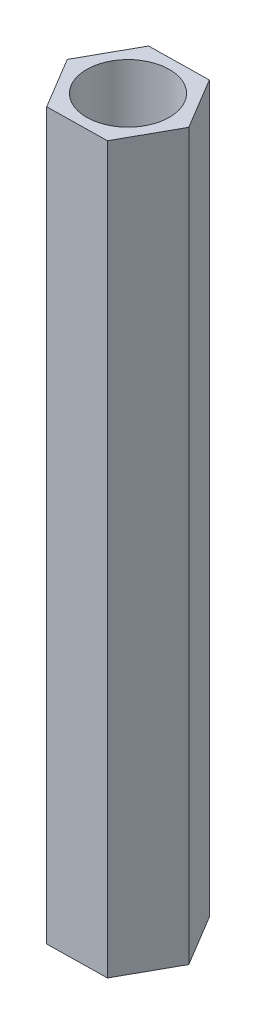
ISO-10303-21;
HEADER;
FILE_DESCRIPTION(('STEP AP214'),'2;1');
FILE_NAME('part.step','',(''),(''),'','','');
FILE_SCHEMA(('AUTOMOTIVE_DESIGN { 1 0 10303 214 1 1 1 1 }'));
ENDSEC;
DATA;
#1=APPLICATION_CONTEXT('core data for automotive mechanical design processes');
#2=APPLICATION_PROTOCOL_DEFINITION('international standard','automotive_design',2000,#1);
#3=PRODUCT_CONTEXT('',#1,'mechanical');
#4=PRODUCT('Part','Part','',(#3));
#5=PRODUCT_RELATED_PRODUCT_CATEGORY('part','',(#4));
#6=PRODUCT_DEFINITION_FORMATION('','',#4);
#7=PRODUCT_DEFINITION_CONTEXT('part definition',#1,'design');
#8=PRODUCT_DEFINITION('design','',#6,#7);
#9=PRODUCT_DEFINITION_SHAPE('','',#8);
#10=(LENGTH_UNIT() NAMED_UNIT(*) SI_UNIT(.MILLI.,.METRE.));
#11=(NAMED_UNIT(*) PLANE_ANGLE_UNIT() SI_UNIT($,.RADIAN.));
#12=(NAMED_UNIT(*) SI_UNIT($,.STERADIAN.) SOLID_ANGLE_UNIT());
#13=UNCERTAINTY_MEASURE_WITH_UNIT(LENGTH_MEASURE(1.E-05),#10,'distance_accuracy_value','');
#14=(GEOMETRIC_REPRESENTATION_CONTEXT(3) GLOBAL_UNCERTAINTY_ASSIGNED_CONTEXT((#13)) GLOBAL_UNIT_ASSIGNED_CONTEXT((#10,
#11,#12)) REPRESENTATION_CONTEXT('',''));
#15=CARTESIAN_POINT('',(0.,0.,0.));
#16=DIRECTION('',(0.,0.,1.));
#17=DIRECTION('',(1.,0.,0.));
#18=AXIS2_PLACEMENT_3D('',#15,#16,#17);
#19=CARTESIAN_POINT('',(0.,35.,0.));
#20=DIRECTION('',(0.,1.,0.));
#21=DIRECTION('',(0.,0.,1.));
#22=AXIS2_PLACEMENT_3D('',#19,#20,#21);
#23=PLANE('',#22);
#24=DIRECTION('',(-0.51422094243495,0.,-0.857657753629798));
#25=VECTOR('',#24,1.);
#26=CARTESIAN_POINT('',(2.88635838291889,35.,-0.0476300187605399));
#27=LINE('',#26,#25);
#28=CARTESIAN_POINT('',(2.88635838291889,35.,-0.0476300187605399));
#29=VERTEX_POINT('',#28);
#30=CARTESIAN_POINT('',(1.40193038523009,35.,-2.52347469341419));
#31=VERTEX_POINT('',#30);
#32=EDGE_CURVE('E137',#29,#31,#27,.T.);
#33=ORIENTED_EDGE('',*,*,#32,.T.);
#34=DIRECTION('',(-0.999863873613576,0.,0.0164995224917422));
#35=VECTOR('',#34,1.);
#36=CARTESIAN_POINT('',(1.40193038523009,35.,-2.52347469341419));
#37=LINE('',#36,#35);
#38=CARTESIAN_POINT('',(-1.4844279976888,35.,-2.47584467465366));
#39=VERTEX_POINT('',#38);
#40=EDGE_CURVE('E95',#31,#39,#37,.T.);
#41=ORIENTED_EDGE('',*,*,#40,.T.);
#42=DIRECTION('',(-0.485642931178626,0.,0.874157276121541));
#43=VECTOR('',#42,1.);
#44=CARTESIAN_POINT('',(-1.4844279976888,35.,-2.47584467465366));
#45=LINE('',#44,#43);
#46=CARTESIAN_POINT('',(-2.88635838291888,35.,0.0476300187605347));
#47=VERTEX_POINT('',#46);
#48=EDGE_CURVE('E108',#39,#47,#45,.T.);
#49=ORIENTED_EDGE('',*,*,#48,.T.);
#50=DIRECTION('',(0.51422094243495,0.,0.857657753629798));
#51=VECTOR('',#50,1.);
#52=CARTESIAN_POINT('',(-2.88635838291888,35.,0.0476300187605347));
#53=LINE('',#52,#51);
#54=CARTESIAN_POINT('',(-1.40193038523008,35.,2.5234746934142));
#55=VERTEX_POINT('',#54);
#56=EDGE_CURVE('E102',#47,#55,#53,.T.);
#57=ORIENTED_EDGE('',*,*,#56,.T.);
#58=DIRECTION('',(0.999863873613576,0.,-0.0164995224917429));
#59=VECTOR('',#58,1.);
#60=CARTESIAN_POINT('',(-1.40193038523008,35.,2.5234746934142));
#61=LINE('',#60,#59);
#62=CARTESIAN_POINT('',(1.4844279976888,35.,2.47584467465366));
#63=VERTEX_POINT('',#62);
#64=EDGE_CURVE('E106',#55,#63,#61,.T.);
#65=ORIENTED_EDGE('',*,*,#64,.T.);
#66=DIRECTION('',(0.485642931178626,0.,-0.874157276121541));
#67=VECTOR('',#66,1.);
#68=CARTESIAN_POINT('',(1.4844279976888,35.,2.47584467465366));
#69=LINE('',#68,#67);
#70=EDGE_CURVE('E58',#63,#29,#69,.T.);
#71=ORIENTED_EDGE('',*,*,#70,.T.);
#72=EDGE_LOOP('',(#33,#41,#49,#57,#65,#71));
#73=FACE_BOUND('',#72,.T.);
#74=CARTESIAN_POINT('',(0.,35.,0.));
#75=DIRECTION('',(0.,1.,0.));
#76=DIRECTION('',(0.,0.,1.));
#77=AXIS2_PLACEMENT_3D('',#74,#75,#76);
#78=CIRCLE('',#77,2.);
#79=CARTESIAN_POINT('',(0.,35.,2.));
#80=VERTEX_POINT('',#79);
#81=EDGE_CURVE('E130',#80,#80,#78,.T.);
#82=ORIENTED_EDGE('',*,*,#81,.F.);
#83=EDGE_LOOP('',(#82));
#84=FACE_BOUND('',#83,.T.);
#85=ADVANCED_FACE('F41',(#73,#84),#23,.T.);
#86=CARTESIAN_POINT('',(0.,0.,0.));
#87=DIRECTION('',(0.,1.,0.));
#88=DIRECTION('',(0.,0.,1.));
#89=AXIS2_PLACEMENT_3D('',#86,#87,#88);
#90=PLANE('',#89);
#91=DIRECTION('',(-0.51422094243495,0.,-0.857657753629798));
#92=VECTOR('',#91,1.);
#93=CARTESIAN_POINT('',(2.88635838291889,0.,-0.0476300187605399));
#94=LINE('',#93,#92);
#95=CARTESIAN_POINT('',(2.88635838291889,0.,-0.0476300187605399));
#96=VERTEX_POINT('',#95);
#97=CARTESIAN_POINT('',(1.40193038523009,0.,-2.52347469341419));
#98=VERTEX_POINT('',#97);
#99=EDGE_CURVE('E126',#96,#98,#94,.T.);
#100=ORIENTED_EDGE('',*,*,#99,.F.);
#101=DIRECTION('',(0.485642931178626,0.,-0.874157276121541));
#102=VECTOR('',#101,1.);
#103=CARTESIAN_POINT('',(1.4844279976888,0.,2.47584467465366));
#104=LINE('',#103,#102);
#105=CARTESIAN_POINT('',(1.4844279976888,0.,2.47584467465366));
#106=VERTEX_POINT('',#105);
#107=EDGE_CURVE('E87',#106,#96,#104,.T.);
#108=ORIENTED_EDGE('',*,*,#107,.F.);
#109=DIRECTION('',(0.999863873613576,0.,-0.0164995224917429));
#110=VECTOR('',#109,1.);
#111=CARTESIAN_POINT('',(-1.40193038523008,0.,2.5234746934142));
#112=LINE('',#111,#110);
#113=CARTESIAN_POINT('',(-1.40193038523008,0.,2.5234746934142));
#114=VERTEX_POINT('',#113);
#115=EDGE_CURVE('E81',#114,#106,#112,.T.);
#116=ORIENTED_EDGE('',*,*,#115,.F.);
#117=DIRECTION('',(0.51422094243495,0.,0.857657753629798));
#118=VECTOR('',#117,1.);
#119=CARTESIAN_POINT('',(-2.88635838291888,0.,0.0476300187605347));
#120=LINE('',#119,#118);
#121=CARTESIAN_POINT('',(-2.88635838291888,0.,0.0476300187605347));
#122=VERTEX_POINT('',#121);
#123=EDGE_CURVE('E116',#122,#114,#120,.T.);
#124=ORIENTED_EDGE('',*,*,#123,.F.);
#125=DIRECTION('',(-0.485642931178626,0.,0.874157276121541));
#126=VECTOR('',#125,1.);
#127=CARTESIAN_POINT('',(-1.4844279976888,0.,-2.47584467465366));
#128=LINE('',#127,#126);
#129=CARTESIAN_POINT('',(-1.4844279976888,0.,-2.47584467465366));
#130=VERTEX_POINT('',#129);
#131=EDGE_CURVE('E132',#130,#122,#128,.T.);
#132=ORIENTED_EDGE('',*,*,#131,.F.);
#133=DIRECTION('',(-0.999863873613576,0.,0.0164995224917422));
#134=VECTOR('',#133,1.);
#135=CARTESIAN_POINT('',(1.40193038523009,0.,-2.52347469341419));
#136=LINE('',#135,#134);
#137=EDGE_CURVE('E129',#98,#130,#136,.T.);
#138=ORIENTED_EDGE('',*,*,#137,.F.);
#139=EDGE_LOOP('',(#100,#108,#116,#124,#132,#138));
#140=FACE_BOUND('',#139,.T.);
#141=CARTESIAN_POINT('',(0.,0.,0.));
#142=DIRECTION('',(0.,1.,0.));
#143=DIRECTION('',(0.,0.,1.));
#144=AXIS2_PLACEMENT_3D('',#141,#142,#143);
#145=CIRCLE('',#144,2.);
#146=CARTESIAN_POINT('',(0.,0.,2.));
#147=VERTEX_POINT('',#146);
#148=EDGE_CURVE('E248',#147,#147,#145,.T.);
#149=ORIENTED_EDGE('',*,*,#148,.T.);
#150=EDGE_LOOP('',(#149));
#151=FACE_BOUND('',#150,.T.);
#152=ADVANCED_FACE('F146',(#140,#151),#90,.F.);
#153=CARTESIAN_POINT('',(2.88635838291889,35.,-0.0476300187605399));
#154=DIRECTION('',(-0.857657753629798,0.,0.51422094243495));
#155=DIRECTION('',(0.51422094243495,0.,0.857657753629798));
#156=AXIS2_PLACEMENT_3D('',#153,#154,#155);
#157=PLANE('',#156);
#158=ORIENTED_EDGE('',*,*,#99,.T.);
#159=DIRECTION('',(0.,-1.,0.));
#160=VECTOR('',#159,1.);
#161=CARTESIAN_POINT('',(1.40193038523009,35.,-2.52347469341419));
#162=LINE('',#161,#160);
#163=EDGE_CURVE('E11',#31,#98,#162,.T.);
#164=ORIENTED_EDGE('',*,*,#163,.F.);
#165=ORIENTED_EDGE('',*,*,#32,.F.);
#166=DIRECTION('',(0.,-1.,0.));
#167=VECTOR('',#166,1.);
#168=CARTESIAN_POINT('',(2.88635838291889,35.,-0.0476300187605399));
#169=LINE('',#168,#167);
#170=EDGE_CURVE('E122',#29,#96,#169,.T.);
#171=ORIENTED_EDGE('',*,*,#170,.T.);
#172=EDGE_LOOP('',(#158,#164,#165,#171));
#173=FACE_BOUND('',#172,.T.);
#174=ADVANCED_FACE('F43',(#173),#157,.F.);
#175=CARTESIAN_POINT('',(1.40193038523009,35.,-2.52347469341419));
#176=DIRECTION('',(0.0164995224917422,0.,0.999863873613576));
#177=DIRECTION('',(0.999863873613576,0.,-0.0164995224917423));
#178=AXIS2_PLACEMENT_3D('',#175,#176,#177);
#179=PLANE('',#178);
#180=ORIENTED_EDGE('',*,*,#137,.T.);
#181=DIRECTION('',(0.,-1.,0.));
#182=VECTOR('',#181,1.);
#183=CARTESIAN_POINT('',(-1.4844279976888,35.,-2.47584467465366));
#184=LINE('',#183,#182);
#185=EDGE_CURVE('E50',#39,#130,#184,.T.);
#186=ORIENTED_EDGE('',*,*,#185,.F.);
#187=ORIENTED_EDGE('',*,*,#40,.F.);
#188=ORIENTED_EDGE('',*,*,#163,.T.);
#189=EDGE_LOOP('',(#180,#186,#187,#188));
#190=FACE_BOUND('',#189,.T.);
#191=ADVANCED_FACE('F171',(#190),#179,.F.);
#192=CARTESIAN_POINT('',(-1.4844279976888,35.,-2.47584467465366));
#193=DIRECTION('',(0.874157276121541,0.,0.485642931178626));
#194=DIRECTION('',(0.485642931178626,0.,-0.874157276121541));
#195=AXIS2_PLACEMENT_3D('',#192,#193,#194);
#196=PLANE('',#195);
#197=ORIENTED_EDGE('',*,*,#131,.T.);
#198=DIRECTION('',(0.,-1.,0.));
#199=VECTOR('',#198,1.);
#200=CARTESIAN_POINT('',(-2.88635838291888,35.,0.0476300187605347));
#201=LINE('',#200,#199);
#202=EDGE_CURVE('E117',#47,#122,#201,.T.);
#203=ORIENTED_EDGE('',*,*,#202,.F.);
#204=ORIENTED_EDGE('',*,*,#48,.F.);
#205=ORIENTED_EDGE('',*,*,#185,.T.);
#206=EDGE_LOOP('',(#197,#203,#204,#205));
#207=FACE_BOUND('',#206,.T.);
#208=ADVANCED_FACE('F143',(#207),#196,.F.);
#209=CARTESIAN_POINT('',(-2.88635838291888,35.,0.0476300187605347));
#210=DIRECTION('',(0.857657753629798,0.,-0.51422094243495));
#211=DIRECTION('',(-0.51422094243495,0.,-0.857657753629798));
#212=AXIS2_PLACEMENT_3D('',#209,#210,#211);
#213=PLANE('',#212);
#214=ORIENTED_EDGE('',*,*,#123,.T.);
#215=DIRECTION('',(0.,-1.,0.));
#216=VECTOR('',#215,1.);
#217=CARTESIAN_POINT('',(-1.40193038523008,35.,2.5234746934142));
#218=LINE('',#217,#216);
#219=EDGE_CURVE('E113',#55,#114,#218,.T.);
#220=ORIENTED_EDGE('',*,*,#219,.F.);
#221=ORIENTED_EDGE('',*,*,#56,.F.);
#222=ORIENTED_EDGE('',*,*,#202,.T.);
#223=EDGE_LOOP('',(#214,#220,#221,#222));
#224=FACE_BOUND('',#223,.T.);
#225=ADVANCED_FACE('F114',(#224),#213,.F.);
#226=CARTESIAN_POINT('',(-1.40193038523008,35.,2.5234746934142));
#227=DIRECTION('',(-0.0164995224917429,0.,-0.999863873613576));
#228=DIRECTION('',(-0.999863873613576,0.,0.0164995224917429));
#229=AXIS2_PLACEMENT_3D('',#226,#227,#228);
#230=PLANE('',#229);
#231=ORIENTED_EDGE('',*,*,#115,.T.);
#232=DIRECTION('',(0.,-1.,0.));
#233=VECTOR('',#232,1.);
#234=CARTESIAN_POINT('',(1.4844279976888,35.,2.47584467465366));
#235=LINE('',#234,#233);
#236=EDGE_CURVE('E118',#63,#106,#235,.T.);
#237=ORIENTED_EDGE('',*,*,#236,.F.);
#238=ORIENTED_EDGE('',*,*,#64,.F.);
#239=ORIENTED_EDGE('',*,*,#219,.T.);
#240=EDGE_LOOP('',(#231,#237,#238,#239));
#241=FACE_BOUND('',#240,.T.);
#242=ADVANCED_FACE('F120',(#241),#230,.F.);
#243=CARTESIAN_POINT('',(1.4844279976888,35.,2.47584467465366));
#244=DIRECTION('',(-0.874157276121541,0.,-0.485642931178626));
#245=DIRECTION('',(-0.485642931178626,0.,0.874157276121541));
#246=AXIS2_PLACEMENT_3D('',#243,#244,#245);
#247=PLANE('',#246);
#248=ORIENTED_EDGE('',*,*,#107,.T.);
#249=ORIENTED_EDGE('',*,*,#170,.F.);
#250=ORIENTED_EDGE('',*,*,#70,.F.);
#251=ORIENTED_EDGE('',*,*,#236,.T.);
#252=EDGE_LOOP('',(#248,#249,#250,#251));
#253=FACE_BOUND('',#252,.T.);
#254=ADVANCED_FACE('F151',(#253),#247,.F.);
#255=CARTESIAN_POINT('',(0.,35.,0.));
#256=DIRECTION('',(0.,-1.,0.));
#257=DIRECTION('',(0.,0.,-1.));
#258=AXIS2_PLACEMENT_3D('',#255,#256,#257);
#259=CYLINDRICAL_SURFACE('',#258,2.);
#260=ORIENTED_EDGE('',*,*,#81,.T.);
#261=EDGE_LOOP('',(#260));
#262=FACE_BOUND('',#261,.T.);
#263=ORIENTED_EDGE('',*,*,#148,.F.);
#264=EDGE_LOOP('',(#263));
#265=FACE_BOUND('',#264,.T.);
#266=ADVANCED_FACE('F153',(#262,#265),#259,.F.);
#267=CLOSED_SHELL('',(#85,#152,#174,#191,#208,#225,#242,#254,#266));
#268=MANIFOLD_SOLID_BREP('B2',#267);
#269=ADVANCED_BREP_SHAPE_REPRESENTATION('',(#18,#268),#14);
#270=SHAPE_DEFINITION_REPRESENTATION(#9,#269);
ENDSEC;
END-ISO-10303-21;
